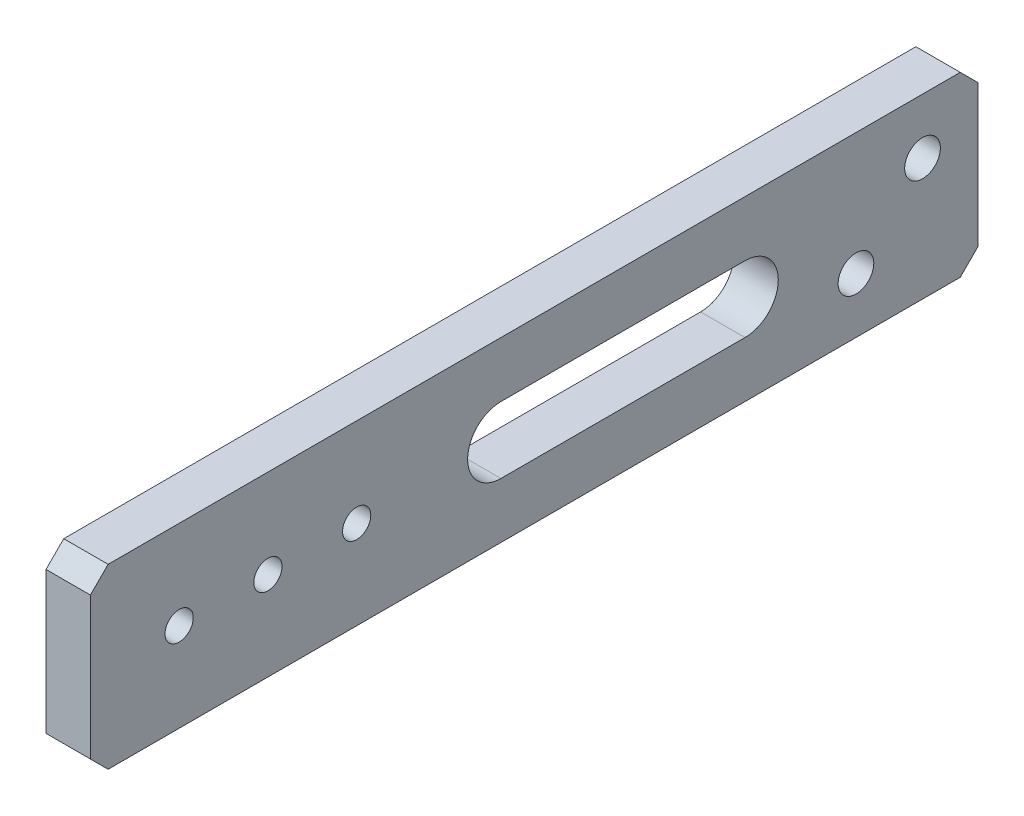
ISO-10303-21;
HEADER;
FILE_DESCRIPTION(('STEP AP214'),'2;1');
FILE_NAME('part.step','',(''),(''),'','','');
FILE_SCHEMA(('AUTOMOTIVE_DESIGN { 1 0 10303 214 1 1 1 1 }'));
ENDSEC;
DATA;
#1=APPLICATION_CONTEXT('core data for automotive mechanical design processes');
#2=APPLICATION_PROTOCOL_DEFINITION('international standard','automotive_design',2000,#1);
#3=PRODUCT_CONTEXT('',#1,'mechanical');
#4=PRODUCT('Part','Part','',(#3));
#5=PRODUCT_RELATED_PRODUCT_CATEGORY('part','',(#4));
#6=PRODUCT_DEFINITION_FORMATION('','',#4);
#7=PRODUCT_DEFINITION_CONTEXT('part definition',#1,'design');
#8=PRODUCT_DEFINITION('design','',#6,#7);
#9=PRODUCT_DEFINITION_SHAPE('','',#8);
#10=(LENGTH_UNIT() NAMED_UNIT(*) SI_UNIT(.MILLI.,.METRE.));
#11=(NAMED_UNIT(*) PLANE_ANGLE_UNIT() SI_UNIT($,.RADIAN.));
#12=(NAMED_UNIT(*) SI_UNIT($,.STERADIAN.) SOLID_ANGLE_UNIT());
#13=UNCERTAINTY_MEASURE_WITH_UNIT(LENGTH_MEASURE(1.E-05),#10,'distance_accuracy_value','');
#14=(GEOMETRIC_REPRESENTATION_CONTEXT(3) GLOBAL_UNCERTAINTY_ASSIGNED_CONTEXT((#13)) GLOBAL_UNIT_ASSIGNED_CONTEXT((#10,
#11,#12)) REPRESENTATION_CONTEXT('',''));
#15=CARTESIAN_POINT('',(0.,0.,0.));
#16=DIRECTION('',(0.,0.,1.));
#17=DIRECTION('',(1.,0.,0.));
#18=AXIS2_PLACEMENT_3D('',#15,#16,#17);
#19=CARTESIAN_POINT('',(6.35,0.,0.));
#20=DIRECTION('',(0.,0.,-1.));
#21=DIRECTION('',(-1.,0.,0.));
#22=AXIS2_PLACEMENT_3D('',#19,#20,#21);
#23=PLANE('',#22);
#24=DIRECTION('',(0.,-1.,0.));
#25=VECTOR('',#24,1.);
#26=CARTESIAN_POINT('',(6.35,0.,0.));
#27=LINE('',#26,#25);
#28=CARTESIAN_POINT('',(6.35,22.86,0.));
#29=VERTEX_POINT('',#28);
#30=CARTESIAN_POINT('',(6.35,2.54,0.));
#31=VERTEX_POINT('',#30);
#32=EDGE_CURVE('E261',#29,#31,#27,.T.);
#33=ORIENTED_EDGE('',*,*,#32,.F.);
#34=DIRECTION('',(-1.,0.,0.));
#35=VECTOR('',#34,1.);
#36=CARTESIAN_POINT('',(6.35,22.86,0.));
#37=LINE('',#36,#35);
#38=CARTESIAN_POINT('',(0.,22.86,0.));
#39=VERTEX_POINT('',#38);
#40=EDGE_CURVE('E295',#29,#39,#37,.T.);
#41=ORIENTED_EDGE('',*,*,#40,.T.);
#42=DIRECTION('',(0.,-1.,0.));
#43=VECTOR('',#42,1.);
#44=CARTESIAN_POINT('',(0.,0.,0.));
#45=LINE('',#44,#43);
#46=CARTESIAN_POINT('',(0.,2.54,0.));
#47=VERTEX_POINT('',#46);
#48=EDGE_CURVE('E260',#39,#47,#45,.T.);
#49=ORIENTED_EDGE('',*,*,#48,.T.);
#50=DIRECTION('',(1.,0.,0.));
#51=VECTOR('',#50,1.);
#52=CARTESIAN_POINT('',(6.35,2.54,0.));
#53=LINE('',#52,#51);
#54=EDGE_CURVE('E278',#47,#31,#53,.T.);
#55=ORIENTED_EDGE('',*,*,#54,.T.);
#56=EDGE_LOOP('',(#33,#41,#49,#55));
#57=FACE_BOUND('',#56,.T.);
#58=ADVANCED_FACE('F58',(#57),#23,.F.);
#59=CARTESIAN_POINT('',(6.35,0.,0.));
#60=DIRECTION('',(0.,1.,0.));
#61=DIRECTION('',(0.,0.,1.));
#62=AXIS2_PLACEMENT_3D('',#59,#60,#61);
#63=PLANE('',#62);
#64=DIRECTION('',(0.,0.,-1.));
#65=VECTOR('',#64,1.);
#66=CARTESIAN_POINT('',(0.,0.,0.));
#67=LINE('',#66,#65);
#68=CARTESIAN_POINT('',(0.,0.,-2.54));
#69=VERTEX_POINT('',#68);
#70=CARTESIAN_POINT('',(0.,0.,-124.46));
#71=VERTEX_POINT('',#70);
#72=EDGE_CURVE('E282',#69,#71,#67,.T.);
#73=ORIENTED_EDGE('',*,*,#72,.T.);
#74=DIRECTION('',(1.,0.,0.));
#75=VECTOR('',#74,1.);
#76=CARTESIAN_POINT('',(6.35,0.,-124.46));
#77=LINE('',#76,#75);
#78=CARTESIAN_POINT('',(6.35,0.,-124.46));
#79=VERTEX_POINT('',#78);
#80=EDGE_CURVE('E11',#71,#79,#77,.T.);
#81=ORIENTED_EDGE('',*,*,#80,.T.);
#82=DIRECTION('',(0.,0.,-1.));
#83=VECTOR('',#82,1.);
#84=CARTESIAN_POINT('',(6.35,0.,0.));
#85=LINE('',#84,#83);
#86=CARTESIAN_POINT('',(6.35,0.,-2.54));
#87=VERTEX_POINT('',#86);
#88=EDGE_CURVE('E265',#87,#79,#85,.T.);
#89=ORIENTED_EDGE('',*,*,#88,.F.);
#90=DIRECTION('',(-1.,0.,0.));
#91=VECTOR('',#90,1.);
#92=CARTESIAN_POINT('',(6.35,0.,-2.54));
#93=LINE('',#92,#91);
#94=EDGE_CURVE('E68',#87,#69,#93,.T.);
#95=ORIENTED_EDGE('',*,*,#94,.T.);
#96=EDGE_LOOP('',(#73,#81,#89,#95));
#97=FACE_BOUND('',#96,.T.);
#98=ADVANCED_FACE('F342',(#97),#63,.F.);
#99=CARTESIAN_POINT('',(6.35,25.4,-127.));
#100=DIRECTION('',(0.,0.,1.));
#101=DIRECTION('',(1.,0.,0.));
#102=AXIS2_PLACEMENT_3D('',#99,#100,#101);
#103=PLANE('',#102);
#104=DIRECTION('',(0.,1.,0.));
#105=VECTOR('',#104,1.);
#106=CARTESIAN_POINT('',(0.,25.4,-127.));
#107=LINE('',#106,#105);
#108=CARTESIAN_POINT('',(0.,2.54,-127.));
#109=VERTEX_POINT('',#108);
#110=CARTESIAN_POINT('',(0.,22.86,-127.));
#111=VERTEX_POINT('',#110);
#112=EDGE_CURVE('E286',#109,#111,#107,.T.);
#113=ORIENTED_EDGE('',*,*,#112,.T.);
#114=DIRECTION('',(1.,0.,0.));
#115=VECTOR('',#114,1.);
#116=CARTESIAN_POINT('',(6.35,22.86,-127.));
#117=LINE('',#116,#115);
#118=CARTESIAN_POINT('',(6.35,22.86,-127.));
#119=VERTEX_POINT('',#118);
#120=EDGE_CURVE('E334',#111,#119,#117,.T.);
#121=ORIENTED_EDGE('',*,*,#120,.T.);
#122=DIRECTION('',(0.,1.,0.));
#123=VECTOR('',#122,1.);
#124=CARTESIAN_POINT('',(6.35,25.4,-127.));
#125=LINE('',#124,#123);
#126=CARTESIAN_POINT('',(6.35,2.54,-127.));
#127=VERTEX_POINT('',#126);
#128=EDGE_CURVE('E270',#127,#119,#125,.T.);
#129=ORIENTED_EDGE('',*,*,#128,.F.);
#130=DIRECTION('',(-1.,0.,0.));
#131=VECTOR('',#130,1.);
#132=CARTESIAN_POINT('',(6.35,2.54,-127.));
#133=LINE('',#132,#131);
#134=EDGE_CURVE('E330',#127,#109,#133,.T.);
#135=ORIENTED_EDGE('',*,*,#134,.T.);
#136=EDGE_LOOP('',(#113,#121,#129,#135));
#137=FACE_BOUND('',#136,.T.);
#138=ADVANCED_FACE('F355',(#137),#103,.F.);
#139=CARTESIAN_POINT('',(6.35,25.4,0.));
#140=DIRECTION('',(0.,-1.,0.));
#141=DIRECTION('',(0.,0.,-1.));
#142=AXIS2_PLACEMENT_3D('',#139,#140,#141);
#143=PLANE('',#142);
#144=DIRECTION('',(0.,0.,1.));
#145=VECTOR('',#144,1.);
#146=CARTESIAN_POINT('',(0.,25.4,0.));
#147=LINE('',#146,#145);
#148=CARTESIAN_POINT('',(0.,25.4,-124.46));
#149=VERTEX_POINT('',#148);
#150=CARTESIAN_POINT('',(0.,25.4,-2.54000000000001));
#151=VERTEX_POINT('',#150);
#152=EDGE_CURVE('E266',#149,#151,#147,.T.);
#153=ORIENTED_EDGE('',*,*,#152,.T.);
#154=DIRECTION('',(1.,0.,0.));
#155=VECTOR('',#154,1.);
#156=CARTESIAN_POINT('',(6.35,25.4,-2.54000000000001));
#157=LINE('',#156,#155);
#158=CARTESIAN_POINT('',(6.35,25.4,-2.54000000000001));
#159=VERTEX_POINT('',#158);
#160=EDGE_CURVE('E315',#151,#159,#157,.T.);
#161=ORIENTED_EDGE('',*,*,#160,.T.);
#162=DIRECTION('',(0.,0.,1.));
#163=VECTOR('',#162,1.);
#164=CARTESIAN_POINT('',(6.35,25.4,0.));
#165=LINE('',#164,#163);
#166=CARTESIAN_POINT('',(6.35,25.4,-124.46));
#167=VERTEX_POINT('',#166);
#168=EDGE_CURVE('E274',#167,#159,#165,.T.);
#169=ORIENTED_EDGE('',*,*,#168,.F.);
#170=DIRECTION('',(-1.,0.,0.));
#171=VECTOR('',#170,1.);
#172=CARTESIAN_POINT('',(6.35,25.4,-124.46));
#173=LINE('',#172,#171);
#174=EDGE_CURVE('E311',#167,#149,#173,.T.);
#175=ORIENTED_EDGE('',*,*,#174,.T.);
#176=EDGE_LOOP('',(#153,#161,#169,#175));
#177=FACE_BOUND('',#176,.T.);
#178=ADVANCED_FACE('F366',(#177),#143,.F.);
#179=CARTESIAN_POINT('',(6.35,0.,0.));
#180=DIRECTION('',(-1.,0.,0.));
#181=DIRECTION('',(0.,0.,1.));
#182=AXIS2_PLACEMENT_3D('',#179,#180,#181);
#183=PLANE('',#182);
#184=DIRECTION('',(0.,0.,1.));
#185=VECTOR('',#184,1.);
#186=CARTESIAN_POINT('',(6.35,17.4625,-93.6625));
#187=LINE('',#186,#185);
#188=CARTESIAN_POINT('',(6.35,17.4625,-93.6625));
#189=VERTEX_POINT('',#188);
#190=CARTESIAN_POINT('',(6.35,17.4625,-58.7375));
#191=VERTEX_POINT('',#190);
#192=EDGE_CURVE('E207',#189,#191,#187,.T.);
#193=ORIENTED_EDGE('',*,*,#192,.F.);
#194=CARTESIAN_POINT('',(6.35,12.7,-93.6625));
#195=DIRECTION('',(1.,0.,0.));
#196=DIRECTION('',(0.,0.,-1.));
#197=AXIS2_PLACEMENT_3D('',#194,#195,#196);
#198=CIRCLE('',#197,4.7625);
#199=CARTESIAN_POINT('',(6.35,7.9375,-93.6625));
#200=VERTEX_POINT('',#199);
#201=EDGE_CURVE('E78',#200,#189,#198,.T.);
#202=ORIENTED_EDGE('',*,*,#201,.F.);
#203=DIRECTION('',(0.,0.,-1.));
#204=VECTOR('',#203,1.);
#205=CARTESIAN_POINT('',(6.35,7.9375,-93.6625));
#206=LINE('',#205,#204);
#207=CARTESIAN_POINT('',(6.35,7.9375,-58.7375));
#208=VERTEX_POINT('',#207);
#209=EDGE_CURVE('E193',#208,#200,#206,.T.);
#210=ORIENTED_EDGE('',*,*,#209,.F.);
#211=CARTESIAN_POINT('',(6.35,12.7,-58.7375));
#212=DIRECTION('',(1.,0.,0.));
#213=DIRECTION('',(0.,0.,-1.));
#214=AXIS2_PLACEMENT_3D('',#211,#212,#213);
#215=CIRCLE('',#214,4.7625);
#216=EDGE_CURVE('E198',#191,#208,#215,.T.);
#217=ORIENTED_EDGE('',*,*,#216,.F.);
#218=EDGE_LOOP('',(#193,#202,#210,#217));
#219=FACE_BOUND('',#218,.T.);
#220=CARTESIAN_POINT('',(6.35,17.4625,-119.0625));
#221=DIRECTION('',(1.,0.,0.));
#222=DIRECTION('',(0.,0.,-1.));
#223=AXIS2_PLACEMENT_3D('',#220,#221,#222);
#224=CIRCLE('',#223,2.5527);
#225=CARTESIAN_POINT('',(6.35,17.4625,-121.6152));
#226=VERTEX_POINT('',#225);
#227=EDGE_CURVE('E215',#226,#226,#224,.T.);
#228=ORIENTED_EDGE('',*,*,#227,.F.);
#229=EDGE_LOOP('',(#228));
#230=FACE_BOUND('',#229,.T.);
#231=CARTESIAN_POINT('',(6.35,7.93749999999999,-109.5375));
#232=DIRECTION('',(1.,0.,0.));
#233=DIRECTION('',(0.,0.,-1.));
#234=AXIS2_PLACEMENT_3D('',#231,#232,#233);
#235=CIRCLE('',#234,2.5527);
#236=CARTESIAN_POINT('',(6.35,7.93749999999999,-112.0902));
#237=VERTEX_POINT('',#236);
#238=EDGE_CURVE('E228',#237,#237,#235,.T.);
#239=ORIENTED_EDGE('',*,*,#238,.F.);
#240=EDGE_LOOP('',(#239));
#241=FACE_BOUND('',#240,.T.);
#242=CARTESIAN_POINT('',(6.35,12.7,-12.7));
#243=DIRECTION('',(1.,0.,0.));
#244=DIRECTION('',(0.,0.,-1.));
#245=AXIS2_PLACEMENT_3D('',#242,#243,#244);
#246=CIRCLE('',#245,2.0193);
#247=CARTESIAN_POINT('',(6.35,12.7,-14.7193));
#248=VERTEX_POINT('',#247);
#249=EDGE_CURVE('E236',#248,#248,#246,.T.);
#250=ORIENTED_EDGE('',*,*,#249,.F.);
#251=EDGE_LOOP('',(#250));
#252=FACE_BOUND('',#251,.T.);
#253=CARTESIAN_POINT('',(6.35,12.7,-25.4));
#254=DIRECTION('',(1.,0.,0.));
#255=DIRECTION('',(0.,0.,-1.));
#256=AXIS2_PLACEMENT_3D('',#253,#254,#255);
#257=CIRCLE('',#256,2.0193);
#258=CARTESIAN_POINT('',(6.35,12.7,-27.4193));
#259=VERTEX_POINT('',#258);
#260=EDGE_CURVE('E244',#259,#259,#257,.T.);
#261=ORIENTED_EDGE('',*,*,#260,.F.);
#262=EDGE_LOOP('',(#261));
#263=FACE_BOUND('',#262,.T.);
#264=CARTESIAN_POINT('',(6.35,12.7,-38.1));
#265=DIRECTION('',(1.,0.,0.));
#266=DIRECTION('',(0.,0.,-1.));
#267=AXIS2_PLACEMENT_3D('',#264,#265,#266);
#268=CIRCLE('',#267,2.0193);
#269=CARTESIAN_POINT('',(6.35,12.7,-40.1193));
#270=VERTEX_POINT('',#269);
#271=EDGE_CURVE('E252',#270,#270,#268,.T.);
#272=ORIENTED_EDGE('',*,*,#271,.F.);
#273=EDGE_LOOP('',(#272));
#274=FACE_BOUND('',#273,.T.);
#275=ORIENTED_EDGE('',*,*,#168,.T.);
#276=DIRECTION('',(0.,0.707106781186546,-0.70710678118655));
#277=VECTOR('',#276,1.);
#278=CARTESIAN_POINT('',(6.35,22.86,0.));
#279=LINE('',#278,#277);
#280=EDGE_CURVE('E327',#159,#29,#279,.F.);
#281=ORIENTED_EDGE('',*,*,#280,.T.);
#282=ORIENTED_EDGE('',*,*,#32,.T.);
#283=DIRECTION('',(0.,0.707106781186548,0.707106781186548));
#284=VECTOR('',#283,1.);
#285=CARTESIAN_POINT('',(6.35,0.,-2.54));
#286=LINE('',#285,#284);
#287=EDGE_CURVE('E318',#31,#87,#286,.F.);
#288=ORIENTED_EDGE('',*,*,#287,.T.);
#289=ORIENTED_EDGE('',*,*,#88,.T.);
#290=DIRECTION('',(0.,-0.707106781186546,0.70710678118655));
#291=VECTOR('',#290,1.);
#292=CARTESIAN_POINT('',(6.35,2.54,-127.));
#293=LINE('',#292,#291);
#294=EDGE_CURVE('E321',#79,#127,#293,.F.);
#295=ORIENTED_EDGE('',*,*,#294,.T.);
#296=ORIENTED_EDGE('',*,*,#128,.T.);
#297=DIRECTION('',(0.,-0.707106781186546,-0.70710678118655));
#298=VECTOR('',#297,1.);
#299=CARTESIAN_POINT('',(6.35,25.4,-124.46));
#300=LINE('',#299,#298);
#301=EDGE_CURVE('E324',#119,#167,#300,.F.);
#302=ORIENTED_EDGE('',*,*,#301,.T.);
#303=EDGE_LOOP('',(#275,#281,#282,#288,#289,#295,#296,#302));
#304=FACE_BOUND('',#303,.T.);
#305=ADVANCED_FACE('F359',(#219,#230,#241,#252,#263,#274,#304),#183,.F.);
#306=CARTESIAN_POINT('',(0.,0.,0.));
#307=DIRECTION('',(-1.,0.,0.));
#308=DIRECTION('',(0.,0.,1.));
#309=AXIS2_PLACEMENT_3D('',#306,#307,#308);
#310=PLANE('',#309);
#311=CARTESIAN_POINT('',(0.,12.7,-93.6625));
#312=DIRECTION('',(1.,0.,0.));
#313=DIRECTION('',(0.,0.,-1.));
#314=AXIS2_PLACEMENT_3D('',#311,#312,#313);
#315=CIRCLE('',#314,4.7625);
#316=CARTESIAN_POINT('',(0.,7.9375,-93.6625));
#317=VERTEX_POINT('',#316);
#318=CARTESIAN_POINT('',(0.,17.4625,-93.6625));
#319=VERTEX_POINT('',#318);
#320=EDGE_CURVE('E174',#317,#319,#315,.T.);
#321=ORIENTED_EDGE('',*,*,#320,.T.);
#322=DIRECTION('',(0.,0.,1.));
#323=VECTOR('',#322,1.);
#324=CARTESIAN_POINT('',(0.,17.4625,-93.6625));
#325=LINE('',#324,#323);
#326=CARTESIAN_POINT('',(0.,17.4625,-58.7375));
#327=VERTEX_POINT('',#326);
#328=EDGE_CURVE('E184',#319,#327,#325,.T.);
#329=ORIENTED_EDGE('',*,*,#328,.T.);
#330=CARTESIAN_POINT('',(0.,12.7,-58.7375));
#331=DIRECTION('',(1.,0.,0.));
#332=DIRECTION('',(0.,0.,-1.));
#333=AXIS2_PLACEMENT_3D('',#330,#331,#332);
#334=CIRCLE('',#333,4.7625);
#335=CARTESIAN_POINT('',(0.,7.9375,-58.7375));
#336=VERTEX_POINT('',#335);
#337=EDGE_CURVE('E89',#327,#336,#334,.T.);
#338=ORIENTED_EDGE('',*,*,#337,.T.);
#339=DIRECTION('',(0.,0.,-1.));
#340=VECTOR('',#339,1.);
#341=CARTESIAN_POINT('',(0.,7.9375,-93.6625));
#342=LINE('',#341,#340);
#343=EDGE_CURVE('E181',#336,#317,#342,.T.);
#344=ORIENTED_EDGE('',*,*,#343,.T.);
#345=EDGE_LOOP('',(#321,#329,#338,#344));
#346=FACE_BOUND('',#345,.T.);
#347=CARTESIAN_POINT('',(0.,17.4625,-119.0625));
#348=DIRECTION('',(1.,0.,0.));
#349=DIRECTION('',(0.,0.,-1.));
#350=AXIS2_PLACEMENT_3D('',#347,#348,#349);
#351=CIRCLE('',#350,2.5527);
#352=CARTESIAN_POINT('',(0.,17.4625,-121.6152));
#353=VERTEX_POINT('',#352);
#354=EDGE_CURVE('E224',#353,#353,#351,.T.);
#355=ORIENTED_EDGE('',*,*,#354,.T.);
#356=EDGE_LOOP('',(#355));
#357=FACE_BOUND('',#356,.T.);
#358=CARTESIAN_POINT('',(0.,7.93749999999999,-109.5375));
#359=DIRECTION('',(1.,0.,0.));
#360=DIRECTION('',(0.,0.,-1.));
#361=AXIS2_PLACEMENT_3D('',#358,#359,#360);
#362=CIRCLE('',#361,2.5527);
#363=CARTESIAN_POINT('',(0.,7.93749999999999,-112.0902));
#364=VERTEX_POINT('',#363);
#365=EDGE_CURVE('E232',#364,#364,#362,.T.);
#366=ORIENTED_EDGE('',*,*,#365,.T.);
#367=EDGE_LOOP('',(#366));
#368=FACE_BOUND('',#367,.T.);
#369=CARTESIAN_POINT('',(0.,12.7,-12.7));
#370=DIRECTION('',(1.,0.,0.));
#371=DIRECTION('',(0.,0.,-1.));
#372=AXIS2_PLACEMENT_3D('',#369,#370,#371);
#373=CIRCLE('',#372,2.0193);
#374=CARTESIAN_POINT('',(0.,12.7,-14.7193));
#375=VERTEX_POINT('',#374);
#376=EDGE_CURVE('E240',#375,#375,#373,.T.);
#377=ORIENTED_EDGE('',*,*,#376,.T.);
#378=EDGE_LOOP('',(#377));
#379=FACE_BOUND('',#378,.T.);
#380=CARTESIAN_POINT('',(0.,12.7,-25.4));
#381=DIRECTION('',(1.,0.,0.));
#382=DIRECTION('',(0.,0.,-1.));
#383=AXIS2_PLACEMENT_3D('',#380,#381,#382);
#384=CIRCLE('',#383,2.0193);
#385=CARTESIAN_POINT('',(0.,12.7,-27.4193));
#386=VERTEX_POINT('',#385);
#387=EDGE_CURVE('E248',#386,#386,#384,.T.);
#388=ORIENTED_EDGE('',*,*,#387,.T.);
#389=EDGE_LOOP('',(#388));
#390=FACE_BOUND('',#389,.T.);
#391=CARTESIAN_POINT('',(0.,12.7,-38.1));
#392=DIRECTION('',(1.,0.,0.));
#393=DIRECTION('',(0.,0.,-1.));
#394=AXIS2_PLACEMENT_3D('',#391,#392,#393);
#395=CIRCLE('',#394,2.0193);
#396=CARTESIAN_POINT('',(0.,12.7,-40.1193));
#397=VERTEX_POINT('',#396);
#398=EDGE_CURVE('E256',#397,#397,#395,.T.);
#399=ORIENTED_EDGE('',*,*,#398,.T.);
#400=EDGE_LOOP('',(#399));
#401=FACE_BOUND('',#400,.T.);
#402=ORIENTED_EDGE('',*,*,#48,.F.);
#403=DIRECTION('',(0.,-0.707106781186546,0.70710678118655));
#404=VECTOR('',#403,1.);
#405=CARTESIAN_POINT('',(0.,11.4300000000001,11.43));
#406=LINE('',#405,#404);
#407=EDGE_CURVE('E308',#39,#151,#406,.F.);
#408=ORIENTED_EDGE('',*,*,#407,.T.);
#409=ORIENTED_EDGE('',*,*,#152,.F.);
#410=DIRECTION('',(0.,0.707106781186546,0.70710678118655));
#411=VECTOR('',#410,1.);
#412=CARTESIAN_POINT('',(0.,74.9300000000001,-74.9299999999997));
#413=LINE('',#412,#411);
#414=EDGE_CURVE('E305',#149,#111,#413,.F.);
#415=ORIENTED_EDGE('',*,*,#414,.T.);
#416=ORIENTED_EDGE('',*,*,#112,.F.);
#417=DIRECTION('',(0.,0.707106781186546,-0.70710678118655));
#418=VECTOR('',#417,1.);
#419=CARTESIAN_POINT('',(0.,-62.23,-62.2299999999997));
#420=LINE('',#419,#418);
#421=EDGE_CURVE('E302',#109,#71,#420,.F.);
#422=ORIENTED_EDGE('',*,*,#421,.T.);
#423=ORIENTED_EDGE('',*,*,#72,.F.);
#424=DIRECTION('',(0.,-0.707106781186548,-0.707106781186548));
#425=VECTOR('',#424,1.);
#426=CARTESIAN_POINT('',(0.,1.27,-1.27));
#427=LINE('',#426,#425);
#428=EDGE_CURVE('E299',#69,#47,#427,.F.);
#429=ORIENTED_EDGE('',*,*,#428,.T.);
#430=EDGE_LOOP('',(#402,#408,#409,#415,#416,#422,#423,#429));
#431=FACE_BOUND('',#430,.T.);
#432=ADVANCED_FACE('F189',(#346,#357,#368,#379,#390,#401,#431),#310,.T.);
#433=CARTESIAN_POINT('',(6.35,12.7,-38.1));
#434=DIRECTION('',(1.,0.,0.));
#435=DIRECTION('',(0.,0.,-1.));
#436=AXIS2_PLACEMENT_3D('',#433,#434,#435);
#437=CYLINDRICAL_SURFACE('',#436,2.0193);
#438=ORIENTED_EDGE('',*,*,#398,.F.);
#439=EDGE_LOOP('',(#438));
#440=FACE_BOUND('',#439,.T.);
#441=ORIENTED_EDGE('',*,*,#271,.T.);
#442=EDGE_LOOP('',(#441));
#443=FACE_BOUND('',#442,.T.);
#444=ADVANCED_FACE('F467',(#440,#443),#437,.F.);
#445=CARTESIAN_POINT('',(6.35,12.7,-25.4));
#446=DIRECTION('',(1.,0.,0.));
#447=DIRECTION('',(0.,0.,-1.));
#448=AXIS2_PLACEMENT_3D('',#445,#446,#447);
#449=CYLINDRICAL_SURFACE('',#448,2.0193);
#450=ORIENTED_EDGE('',*,*,#387,.F.);
#451=EDGE_LOOP('',(#450));
#452=FACE_BOUND('',#451,.T.);
#453=ORIENTED_EDGE('',*,*,#260,.T.);
#454=EDGE_LOOP('',(#453));
#455=FACE_BOUND('',#454,.T.);
#456=ADVANCED_FACE('F462',(#452,#455),#449,.F.);
#457=CARTESIAN_POINT('',(6.35,12.7,-12.7));
#458=DIRECTION('',(1.,0.,0.));
#459=DIRECTION('',(0.,0.,-1.));
#460=AXIS2_PLACEMENT_3D('',#457,#458,#459);
#461=CYLINDRICAL_SURFACE('',#460,2.0193);
#462=ORIENTED_EDGE('',*,*,#376,.F.);
#463=EDGE_LOOP('',(#462));
#464=FACE_BOUND('',#463,.T.);
#465=ORIENTED_EDGE('',*,*,#249,.T.);
#466=EDGE_LOOP('',(#465));
#467=FACE_BOUND('',#466,.T.);
#468=ADVANCED_FACE('F466',(#464,#467),#461,.F.);
#469=CARTESIAN_POINT('',(6.35,7.93749999999999,-109.5375));
#470=DIRECTION('',(1.,0.,0.));
#471=DIRECTION('',(0.,0.,-1.));
#472=AXIS2_PLACEMENT_3D('',#469,#470,#471);
#473=CYLINDRICAL_SURFACE('',#472,2.5527);
#474=ORIENTED_EDGE('',*,*,#365,.F.);
#475=EDGE_LOOP('',(#474));
#476=FACE_BOUND('',#475,.T.);
#477=ORIENTED_EDGE('',*,*,#238,.T.);
#478=EDGE_LOOP('',(#477));
#479=FACE_BOUND('',#478,.T.);
#480=ADVANCED_FACE('F542',(#476,#479),#473,.F.);
#481=CARTESIAN_POINT('',(6.35,17.4625,-119.0625));
#482=DIRECTION('',(1.,0.,0.));
#483=DIRECTION('',(0.,0.,-1.));
#484=AXIS2_PLACEMENT_3D('',#481,#482,#483);
#485=CYLINDRICAL_SURFACE('',#484,2.5527);
#486=ORIENTED_EDGE('',*,*,#354,.F.);
#487=EDGE_LOOP('',(#486));
#488=FACE_BOUND('',#487,.T.);
#489=ORIENTED_EDGE('',*,*,#227,.T.);
#490=EDGE_LOOP('',(#489));
#491=FACE_BOUND('',#490,.T.);
#492=ADVANCED_FACE('F397',(#488,#491),#485,.F.);
#493=CARTESIAN_POINT('',(6.35,22.86,0.));
#494=DIRECTION('',(0.,-0.70710678118655,-0.707106781186546));
#495=DIRECTION('',(-1.,0.,0.));
#496=AXIS2_PLACEMENT_3D('',#493,#494,#495);
#497=PLANE('',#496);
#498=ORIENTED_EDGE('',*,*,#280,.F.);
#499=ORIENTED_EDGE('',*,*,#160,.F.);
#500=ORIENTED_EDGE('',*,*,#407,.F.);
#501=ORIENTED_EDGE('',*,*,#40,.F.);
#502=EDGE_LOOP('',(#498,#499,#500,#501));
#503=FACE_BOUND('',#502,.T.);
#504=ADVANCED_FACE('F371',(#503),#497,.F.);
#505=CARTESIAN_POINT('',(6.35,25.4,-124.46));
#506=DIRECTION('',(0.,-0.70710678118655,0.707106781186546));
#507=DIRECTION('',(-1.,0.,0.));
#508=AXIS2_PLACEMENT_3D('',#505,#506,#507);
#509=PLANE('',#508);
#510=ORIENTED_EDGE('',*,*,#301,.F.);
#511=ORIENTED_EDGE('',*,*,#120,.F.);
#512=ORIENTED_EDGE('',*,*,#414,.F.);
#513=ORIENTED_EDGE('',*,*,#174,.F.);
#514=EDGE_LOOP('',(#510,#511,#512,#513));
#515=FACE_BOUND('',#514,.T.);
#516=ADVANCED_FACE('F363',(#515),#509,.F.);
#517=CARTESIAN_POINT('',(6.35,2.54,-127.));
#518=DIRECTION('',(0.,0.70710678118655,0.707106781186546));
#519=DIRECTION('',(-1.,0.,0.));
#520=AXIS2_PLACEMENT_3D('',#517,#518,#519);
#521=PLANE('',#520);
#522=ORIENTED_EDGE('',*,*,#294,.F.);
#523=ORIENTED_EDGE('',*,*,#80,.F.);
#524=ORIENTED_EDGE('',*,*,#421,.F.);
#525=ORIENTED_EDGE('',*,*,#134,.F.);
#526=EDGE_LOOP('',(#522,#523,#524,#525));
#527=FACE_BOUND('',#526,.T.);
#528=ADVANCED_FACE('F352',(#527),#521,.F.);
#529=CARTESIAN_POINT('',(6.35,0.,-2.54));
#530=DIRECTION('',(0.,0.707106781186548,-0.707106781186548));
#531=DIRECTION('',(-1.,0.,0.));
#532=AXIS2_PLACEMENT_3D('',#529,#530,#531);
#533=PLANE('',#532);
#534=ORIENTED_EDGE('',*,*,#287,.F.);
#535=ORIENTED_EDGE('',*,*,#54,.F.);
#536=ORIENTED_EDGE('',*,*,#428,.F.);
#537=ORIENTED_EDGE('',*,*,#94,.F.);
#538=EDGE_LOOP('',(#534,#535,#536,#537));
#539=FACE_BOUND('',#538,.T.);
#540=ADVANCED_FACE('F61',(#539),#533,.F.);
#541=CARTESIAN_POINT('',(0.,12.7,-93.6625));
#542=DIRECTION('',(1.,0.,0.));
#543=DIRECTION('',(0.,0.,-1.));
#544=AXIS2_PLACEMENT_3D('',#541,#542,#543);
#545=CYLINDRICAL_SURFACE('',#544,4.7625);
#546=ORIENTED_EDGE('',*,*,#201,.T.);
#547=DIRECTION('',(1.,0.,0.));
#548=VECTOR('',#547,1.);
#549=CARTESIAN_POINT('',(0.,17.4625,-93.6625));
#550=LINE('',#549,#548);
#551=EDGE_CURVE('E170',#319,#189,#550,.T.);
#552=ORIENTED_EDGE('',*,*,#551,.F.);
#553=ORIENTED_EDGE('',*,*,#320,.F.);
#554=DIRECTION('',(1.,0.,0.));
#555=VECTOR('',#554,1.);
#556=CARTESIAN_POINT('',(0.,7.9375,-93.6625));
#557=LINE('',#556,#555);
#558=EDGE_CURVE('E212',#317,#200,#557,.T.);
#559=ORIENTED_EDGE('',*,*,#558,.T.);
#560=EDGE_LOOP('',(#546,#552,#553,#559));
#561=FACE_BOUND('',#560,.T.);
#562=ADVANCED_FACE('F172',(#561),#545,.F.);
#563=CARTESIAN_POINT('',(0.,7.9375,-93.6625));
#564=DIRECTION('',(0.,-1.,0.));
#565=DIRECTION('',(0.,0.,-1.));
#566=AXIS2_PLACEMENT_3D('',#563,#564,#565);
#567=PLANE('',#566);
#568=ORIENTED_EDGE('',*,*,#209,.T.);
#569=ORIENTED_EDGE('',*,*,#558,.F.);
#570=ORIENTED_EDGE('',*,*,#343,.F.);
#571=DIRECTION('',(1.,0.,0.));
#572=VECTOR('',#571,1.);
#573=CARTESIAN_POINT('',(0.,7.9375,-58.7375));
#574=LINE('',#573,#572);
#575=EDGE_CURVE('E216',#336,#208,#574,.T.);
#576=ORIENTED_EDGE('',*,*,#575,.T.);
#577=EDGE_LOOP('',(#568,#569,#570,#576));
#578=FACE_BOUND('',#577,.T.);
#579=ADVANCED_FACE('F381',(#578),#567,.F.);
#580=CARTESIAN_POINT('',(0.,12.7,-58.7375));
#581=DIRECTION('',(1.,0.,0.));
#582=DIRECTION('',(0.,0.,-1.));
#583=AXIS2_PLACEMENT_3D('',#580,#581,#582);
#584=CYLINDRICAL_SURFACE('',#583,4.7625);
#585=ORIENTED_EDGE('',*,*,#216,.T.);
#586=ORIENTED_EDGE('',*,*,#575,.F.);
#587=ORIENTED_EDGE('',*,*,#337,.F.);
#588=DIRECTION('',(1.,0.,0.));
#589=VECTOR('',#588,1.);
#590=CARTESIAN_POINT('',(0.,17.4625,-58.7375));
#591=LINE('',#590,#589);
#592=EDGE_CURVE('E180',#327,#191,#591,.T.);
#593=ORIENTED_EDGE('',*,*,#592,.T.);
#594=EDGE_LOOP('',(#585,#586,#587,#593));
#595=FACE_BOUND('',#594,.T.);
#596=ADVANCED_FACE('F439',(#595),#584,.F.);
#597=CARTESIAN_POINT('',(0.,17.4625,-93.6625));
#598=DIRECTION('',(0.,1.,0.));
#599=DIRECTION('',(0.,0.,1.));
#600=AXIS2_PLACEMENT_3D('',#597,#598,#599);
#601=PLANE('',#600);
#602=ORIENTED_EDGE('',*,*,#192,.T.);
#603=ORIENTED_EDGE('',*,*,#592,.F.);
#604=ORIENTED_EDGE('',*,*,#328,.F.);
#605=ORIENTED_EDGE('',*,*,#551,.T.);
#606=EDGE_LOOP('',(#602,#603,#604,#605));
#607=FACE_BOUND('',#606,.T.);
#608=ADVANCED_FACE('F185',(#607),#601,.F.);
#609=CLOSED_SHELL('',(#58,#98,#138,#178,#305,#432,#444,#456,#468,#480,#492,#504,#516,#528,#540,
#562,#579,#596,#608));
#610=MANIFOLD_SOLID_BREP('B2',#609);
#611=ADVANCED_BREP_SHAPE_REPRESENTATION('',(#18,#610),#14);
#612=SHAPE_DEFINITION_REPRESENTATION(#9,#611);
ENDSEC;
END-ISO-10303-21;
